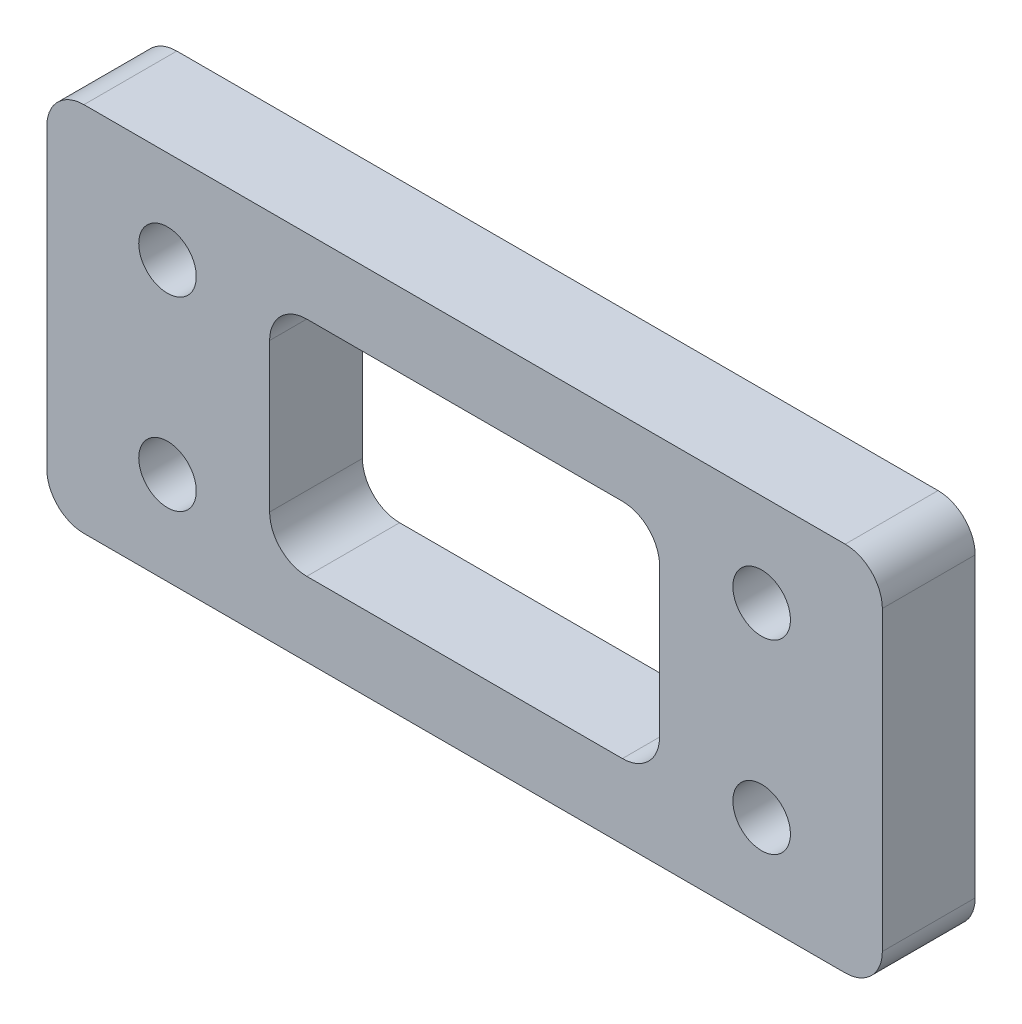
ISO-10303-21;
HEADER;
FILE_DESCRIPTION(('STEP AP214'),'2;1');
FILE_NAME('part.step','',(''),(''),'','','');
FILE_SCHEMA(('AUTOMOTIVE_DESIGN { 1 0 10303 214 1 1 1 1 }'));
ENDSEC;
DATA;
#1=APPLICATION_CONTEXT('core data for automotive mechanical design processes');
#2=APPLICATION_PROTOCOL_DEFINITION('international standard','automotive_design',2000,#1);
#3=PRODUCT_CONTEXT('',#1,'mechanical');
#4=PRODUCT('Part','Part','',(#3));
#5=PRODUCT_RELATED_PRODUCT_CATEGORY('part','',(#4));
#6=PRODUCT_DEFINITION_FORMATION('','',#4);
#7=PRODUCT_DEFINITION_CONTEXT('part definition',#1,'design');
#8=PRODUCT_DEFINITION('design','',#6,#7);
#9=PRODUCT_DEFINITION_SHAPE('','',#8);
#10=(LENGTH_UNIT() NAMED_UNIT(*) SI_UNIT(.MILLI.,.METRE.));
#11=(NAMED_UNIT(*) PLANE_ANGLE_UNIT() SI_UNIT($,.RADIAN.));
#12=(NAMED_UNIT(*) SI_UNIT($,.STERADIAN.) SOLID_ANGLE_UNIT());
#13=UNCERTAINTY_MEASURE_WITH_UNIT(LENGTH_MEASURE(1.E-05),#10,'distance_accuracy_value','');
#14=(GEOMETRIC_REPRESENTATION_CONTEXT(3) GLOBAL_UNCERTAINTY_ASSIGNED_CONTEXT((#13)) GLOBAL_UNIT_ASSIGNED_CONTEXT((#10,
#11,#12)) REPRESENTATION_CONTEXT('',''));
#15=CARTESIAN_POINT('',(0.,0.,0.));
#16=DIRECTION('',(0.,0.,1.));
#17=DIRECTION('',(1.,0.,0.));
#18=AXIS2_PLACEMENT_3D('',#15,#16,#17);
#19=CARTESIAN_POINT('',(22.5,-10.,2.5));
#20=DIRECTION('',(-1.,0.,0.));
#21=DIRECTION('',(0.,0.,1.));
#22=AXIS2_PLACEMENT_3D('',#19,#20,#21);
#23=PLANE('',#22);
#24=DIRECTION('',(0.,1.,0.));
#25=VECTOR('',#24,1.);
#26=CARTESIAN_POINT('',(22.5,-10.,2.5));
#27=LINE('',#26,#25);
#28=CARTESIAN_POINT('',(22.5,-8.,2.5));
#29=VERTEX_POINT('',#28);
#30=CARTESIAN_POINT('',(22.5,8.,2.5));
#31=VERTEX_POINT('',#30);
#32=EDGE_CURVE('E175',#29,#31,#27,.T.);
#33=ORIENTED_EDGE('',*,*,#32,.F.);
#34=DIRECTION('',(0.,0.,-1.));
#35=VECTOR('',#34,1.);
#36=CARTESIAN_POINT('',(22.5,-8.,2.5));
#37=LINE('',#36,#35);
#38=CARTESIAN_POINT('',(22.5,-8.,-2.5));
#39=VERTEX_POINT('',#38);
#40=EDGE_CURVE('E224',#29,#39,#37,.T.);
#41=ORIENTED_EDGE('',*,*,#40,.T.);
#42=DIRECTION('',(0.,1.,0.));
#43=VECTOR('',#42,1.);
#44=CARTESIAN_POINT('',(22.5,-10.,-2.5));
#45=LINE('',#44,#43);
#46=CARTESIAN_POINT('',(22.5,8.,-2.5));
#47=VERTEX_POINT('',#46);
#48=EDGE_CURVE('E320',#39,#47,#45,.T.);
#49=ORIENTED_EDGE('',*,*,#48,.T.);
#50=DIRECTION('',(0.,0.,-1.));
#51=VECTOR('',#50,1.);
#52=CARTESIAN_POINT('',(22.5,8.,2.5));
#53=LINE('',#52,#51);
#54=EDGE_CURVE('E222',#47,#31,#53,.F.);
#55=ORIENTED_EDGE('',*,*,#54,.T.);
#56=EDGE_LOOP('',(#33,#41,#49,#55));
#57=FACE_BOUND('',#56,.T.);
#58=ADVANCED_FACE('F35',(#57),#23,.F.);
#59=CARTESIAN_POINT('',(-22.5,10.,2.5));
#60=DIRECTION('',(0.,-1.,0.));
#61=DIRECTION('',(0.,0.,-1.));
#62=AXIS2_PLACEMENT_3D('',#59,#60,#61);
#63=PLANE('',#62);
#64=DIRECTION('',(-1.,0.,0.));
#65=VECTOR('',#64,1.);
#66=CARTESIAN_POINT('',(-22.5,10.,-2.5));
#67=LINE('',#66,#65);
#68=CARTESIAN_POINT('',(20.5,10.,-2.5));
#69=VERTEX_POINT('',#68);
#70=CARTESIAN_POINT('',(-20.5,10.,-2.5));
#71=VERTEX_POINT('',#70);
#72=EDGE_CURVE('E181',#69,#71,#67,.T.);
#73=ORIENTED_EDGE('',*,*,#72,.T.);
#74=DIRECTION('',(0.,0.,-1.));
#75=VECTOR('',#74,1.);
#76=CARTESIAN_POINT('',(-20.5,10.,2.5));
#77=LINE('',#76,#75);
#78=CARTESIAN_POINT('',(-20.5,10.,2.5));
#79=VERTEX_POINT('',#78);
#80=EDGE_CURVE('E220',#71,#79,#77,.F.);
#81=ORIENTED_EDGE('',*,*,#80,.T.);
#82=DIRECTION('',(-1.,0.,0.));
#83=VECTOR('',#82,1.);
#84=CARTESIAN_POINT('',(-22.5,10.,2.5));
#85=LINE('',#84,#83);
#86=CARTESIAN_POINT('',(20.5,10.,2.5));
#87=VERTEX_POINT('',#86);
#88=EDGE_CURVE('E179',#87,#79,#85,.T.);
#89=ORIENTED_EDGE('',*,*,#88,.F.);
#90=DIRECTION('',(0.,0.,-1.));
#91=VECTOR('',#90,1.);
#92=CARTESIAN_POINT('',(20.5,10.,2.5));
#93=LINE('',#92,#91);
#94=EDGE_CURVE('E217',#87,#69,#93,.T.);
#95=ORIENTED_EDGE('',*,*,#94,.T.);
#96=EDGE_LOOP('',(#73,#81,#89,#95));
#97=FACE_BOUND('',#96,.T.);
#98=ADVANCED_FACE('F333',(#97),#63,.F.);
#99=CARTESIAN_POINT('',(-22.5,-10.,2.5));
#100=DIRECTION('',(1.,0.,0.));
#101=DIRECTION('',(0.,0.,-1.));
#102=AXIS2_PLACEMENT_3D('',#99,#100,#101);
#103=PLANE('',#102);
#104=DIRECTION('',(0.,-1.,0.));
#105=VECTOR('',#104,1.);
#106=CARTESIAN_POINT('',(-22.5,-10.,-2.5));
#107=LINE('',#106,#105);
#108=CARTESIAN_POINT('',(-22.5,8.,-2.5));
#109=VERTEX_POINT('',#108);
#110=CARTESIAN_POINT('',(-22.5,-8.,-2.5));
#111=VERTEX_POINT('',#110);
#112=EDGE_CURVE('E176',#109,#111,#107,.T.);
#113=ORIENTED_EDGE('',*,*,#112,.T.);
#114=DIRECTION('',(0.,0.,-1.));
#115=VECTOR('',#114,1.);
#116=CARTESIAN_POINT('',(-22.5,-8.,2.5));
#117=LINE('',#116,#115);
#118=CARTESIAN_POINT('',(-22.5,-8.,2.5));
#119=VERTEX_POINT('',#118);
#120=EDGE_CURVE('E153',#111,#119,#117,.F.);
#121=ORIENTED_EDGE('',*,*,#120,.T.);
#122=DIRECTION('',(0.,-1.,0.));
#123=VECTOR('',#122,1.);
#124=CARTESIAN_POINT('',(-22.5,-10.,2.5));
#125=LINE('',#124,#123);
#126=CARTESIAN_POINT('',(-22.5,8.,2.5));
#127=VERTEX_POINT('',#126);
#128=EDGE_CURVE('E324',#127,#119,#125,.T.);
#129=ORIENTED_EDGE('',*,*,#128,.F.);
#130=DIRECTION('',(0.,0.,-1.));
#131=VECTOR('',#130,1.);
#132=CARTESIAN_POINT('',(-22.5,8.,2.5));
#133=LINE('',#132,#131);
#134=EDGE_CURVE('E158',#127,#109,#133,.T.);
#135=ORIENTED_EDGE('',*,*,#134,.T.);
#136=EDGE_LOOP('',(#113,#121,#129,#135));
#137=FACE_BOUND('',#136,.T.);
#138=ADVANCED_FACE('F343',(#137),#103,.F.);
#139=CARTESIAN_POINT('',(-22.5,-10.,2.5));
#140=DIRECTION('',(0.,1.,0.));
#141=DIRECTION('',(0.,0.,1.));
#142=AXIS2_PLACEMENT_3D('',#139,#140,#141);
#143=PLANE('',#142);
#144=DIRECTION('',(1.,0.,0.));
#145=VECTOR('',#144,1.);
#146=CARTESIAN_POINT('',(-22.5,-10.,2.5));
#147=LINE('',#146,#145);
#148=CARTESIAN_POINT('',(-20.5,-10.,2.5));
#149=VERTEX_POINT('',#148);
#150=CARTESIAN_POINT('',(20.5,-10.,2.5));
#151=VERTEX_POINT('',#150);
#152=EDGE_CURVE('E168',#149,#151,#147,.T.);
#153=ORIENTED_EDGE('',*,*,#152,.F.);
#154=DIRECTION('',(0.,0.,-1.));
#155=VECTOR('',#154,1.);
#156=CARTESIAN_POINT('',(-20.5,-10.,2.5));
#157=LINE('',#156,#155);
#158=CARTESIAN_POINT('',(-20.5,-10.,-2.5));
#159=VERTEX_POINT('',#158);
#160=EDGE_CURVE('E152',#149,#159,#157,.T.);
#161=ORIENTED_EDGE('',*,*,#160,.T.);
#162=DIRECTION('',(1.,0.,0.));
#163=VECTOR('',#162,1.);
#164=CARTESIAN_POINT('',(-22.5,-10.,-2.5));
#165=LINE('',#164,#163);
#166=CARTESIAN_POINT('',(20.5,-10.,-2.5));
#167=VERTEX_POINT('',#166);
#168=EDGE_CURVE('E165',#159,#167,#165,.T.);
#169=ORIENTED_EDGE('',*,*,#168,.T.);
#170=DIRECTION('',(0.,0.,-1.));
#171=VECTOR('',#170,1.);
#172=CARTESIAN_POINT('',(20.5,-10.,2.5));
#173=LINE('',#172,#171);
#174=EDGE_CURVE('E170',#167,#151,#173,.F.);
#175=ORIENTED_EDGE('',*,*,#174,.T.);
#176=EDGE_LOOP('',(#153,#161,#169,#175));
#177=FACE_BOUND('',#176,.T.);
#178=ADVANCED_FACE('F164',(#177),#143,.F.);
#179=CARTESIAN_POINT('',(0.,0.,2.5));
#180=DIRECTION('',(0.,0.,-1.));
#181=DIRECTION('',(-1.,0.,0.));
#182=AXIS2_PLACEMENT_3D('',#179,#180,#181);
#183=PLANE('',#182);
#184=DIRECTION('',(-1.,0.,0.));
#185=VECTOR('',#184,1.);
#186=CARTESIAN_POINT('',(-10.5,6.,2.5));
#187=LINE('',#186,#185);
#188=CARTESIAN_POINT('',(8.5,6.,2.5));
#189=VERTEX_POINT('',#188);
#190=CARTESIAN_POINT('',(-8.5,6.,2.5));
#191=VERTEX_POINT('',#190);
#192=EDGE_CURVE('E272',#189,#191,#187,.T.);
#193=ORIENTED_EDGE('',*,*,#192,.F.);
#194=CARTESIAN_POINT('',(8.5,4.,2.5));
#195=DIRECTION('',(0.,0.,-1.));
#196=DIRECTION('',(-1.,0.,0.));
#197=AXIS2_PLACEMENT_3D('',#194,#195,#196);
#198=CIRCLE('',#197,2.);
#199=CARTESIAN_POINT('',(10.5,4.,2.5));
#200=VERTEX_POINT('',#199);
#201=EDGE_CURVE('E262',#189,#200,#198,.T.);
#202=ORIENTED_EDGE('',*,*,#201,.T.);
#203=DIRECTION('',(0.,1.,0.));
#204=VECTOR('',#203,1.);
#205=CARTESIAN_POINT('',(10.5,-6.,2.5));
#206=LINE('',#205,#204);
#207=CARTESIAN_POINT('',(10.5,-4.,2.5));
#208=VERTEX_POINT('',#207);
#209=EDGE_CURVE('E278',#208,#200,#206,.T.);
#210=ORIENTED_EDGE('',*,*,#209,.F.);
#211=CARTESIAN_POINT('',(8.5,-4.,2.5));
#212=DIRECTION('',(0.,0.,-1.));
#213=DIRECTION('',(-1.,0.,0.));
#214=AXIS2_PLACEMENT_3D('',#211,#212,#213);
#215=CIRCLE('',#214,2.);
#216=CARTESIAN_POINT('',(8.5,-6.,2.5));
#217=VERTEX_POINT('',#216);
#218=EDGE_CURVE('E258',#208,#217,#215,.T.);
#219=ORIENTED_EDGE('',*,*,#218,.T.);
#220=DIRECTION('',(1.,0.,0.));
#221=VECTOR('',#220,1.);
#222=CARTESIAN_POINT('',(-10.5,-6.,2.5));
#223=LINE('',#222,#221);
#224=CARTESIAN_POINT('',(-8.49999999999999,-6.,2.5));
#225=VERTEX_POINT('',#224);
#226=EDGE_CURVE('E189',#225,#217,#223,.T.);
#227=ORIENTED_EDGE('',*,*,#226,.F.);
#228=CARTESIAN_POINT('',(-8.49999999999999,-4.,2.5));
#229=DIRECTION('',(0.,0.,-1.));
#230=DIRECTION('',(-1.,0.,0.));
#231=AXIS2_PLACEMENT_3D('',#228,#229,#230);
#232=CIRCLE('',#231,2.);
#233=CARTESIAN_POINT('',(-10.5,-4.00000000000001,2.5));
#234=VERTEX_POINT('',#233);
#235=EDGE_CURVE('E50',#225,#234,#232,.T.);
#236=ORIENTED_EDGE('',*,*,#235,.T.);
#237=DIRECTION('',(0.,-1.,0.));
#238=VECTOR('',#237,1.);
#239=CARTESIAN_POINT('',(-10.5,-6.,2.5));
#240=LINE('',#239,#238);
#241=CARTESIAN_POINT('',(-10.5,3.99999999999999,2.5));
#242=VERTEX_POINT('',#241);
#243=EDGE_CURVE('E273',#242,#234,#240,.T.);
#244=ORIENTED_EDGE('',*,*,#243,.F.);
#245=CARTESIAN_POINT('',(-8.5,4.,2.5));
#246=DIRECTION('',(0.,0.,-1.));
#247=DIRECTION('',(-1.,0.,0.));
#248=AXIS2_PLACEMENT_3D('',#245,#246,#247);
#249=CIRCLE('',#248,2.);
#250=EDGE_CURVE('E43',#242,#191,#249,.T.);
#251=ORIENTED_EDGE('',*,*,#250,.T.);
#252=EDGE_LOOP('',(#193,#202,#210,#219,#227,#236,#244,#251));
#253=FACE_BOUND('',#252,.T.);
#254=CARTESIAN_POINT('',(15.9999999999999,-5.00000000000011,2.5));
#255=DIRECTION('',(0.,0.,-1.));
#256=DIRECTION('',(-1.,0.,0.));
#257=AXIS2_PLACEMENT_3D('',#254,#255,#256);
#258=CIRCLE('',#257,1.54999999999997);
#259=CARTESIAN_POINT('',(14.4499999999999,-5.00000000000011,2.5));
#260=VERTEX_POINT('',#259);
#261=EDGE_CURVE('E201',#260,#260,#258,.T.);
#262=ORIENTED_EDGE('',*,*,#261,.T.);
#263=EDGE_LOOP('',(#262));
#264=FACE_BOUND('',#263,.T.);
#265=CARTESIAN_POINT('',(-16.0000000000002,-5.00000000000011,2.5));
#266=DIRECTION('',(0.,0.,-1.));
#267=DIRECTION('',(-1.,0.,0.));
#268=AXIS2_PLACEMENT_3D('',#265,#266,#267);
#269=CIRCLE('',#268,1.54999999999994);
#270=CARTESIAN_POINT('',(-17.5500000000001,-5.00000000000011,2.5));
#271=VERTEX_POINT('',#270);
#272=EDGE_CURVE('E197',#271,#271,#269,.T.);
#273=ORIENTED_EDGE('',*,*,#272,.T.);
#274=EDGE_LOOP('',(#273));
#275=FACE_BOUND('',#274,.T.);
#276=CARTESIAN_POINT('',(-16.0000000000002,5.00000000000014,2.5));
#277=DIRECTION('',(0.,0.,-1.));
#278=DIRECTION('',(-1.,0.,0.));
#279=AXIS2_PLACEMENT_3D('',#276,#277,#278);
#280=CIRCLE('',#279,1.54999999999994);
#281=CARTESIAN_POINT('',(-17.5500000000001,5.00000000000014,2.5));
#282=VERTEX_POINT('',#281);
#283=EDGE_CURVE('E193',#282,#282,#280,.T.);
#284=ORIENTED_EDGE('',*,*,#283,.T.);
#285=EDGE_LOOP('',(#284));
#286=FACE_BOUND('',#285,.T.);
#287=CARTESIAN_POINT('',(15.9999999999999,5.00000000000014,2.5));
#288=DIRECTION('',(0.,0.,-1.));
#289=DIRECTION('',(-1.,0.,0.));
#290=AXIS2_PLACEMENT_3D('',#287,#288,#289);
#291=CIRCLE('',#290,1.54999999999997);
#292=CARTESIAN_POINT('',(14.4499999999999,5.00000000000014,2.5));
#293=VERTEX_POINT('',#292);
#294=EDGE_CURVE('E188',#293,#293,#291,.T.);
#295=ORIENTED_EDGE('',*,*,#294,.T.);
#296=EDGE_LOOP('',(#295));
#297=FACE_BOUND('',#296,.T.);
#298=ORIENTED_EDGE('',*,*,#128,.T.);
#299=CARTESIAN_POINT('',(-20.5,-8.,2.5));
#300=DIRECTION('',(0.,0.,-1.));
#301=DIRECTION('',(-1.,0.,0.));
#302=AXIS2_PLACEMENT_3D('',#299,#300,#301);
#303=CIRCLE('',#302,2.);
#304=EDGE_CURVE('E215',#119,#149,#303,.F.);
#305=ORIENTED_EDGE('',*,*,#304,.T.);
#306=ORIENTED_EDGE('',*,*,#152,.T.);
#307=CARTESIAN_POINT('',(20.5,-8.,2.5));
#308=DIRECTION('',(0.,0.,-1.));
#309=DIRECTION('',(-1.,0.,0.));
#310=AXIS2_PLACEMENT_3D('',#307,#308,#309);
#311=CIRCLE('',#310,2.);
#312=EDGE_CURVE('E211',#151,#29,#311,.F.);
#313=ORIENTED_EDGE('',*,*,#312,.T.);
#314=ORIENTED_EDGE('',*,*,#32,.T.);
#315=CARTESIAN_POINT('',(20.5,8.,2.5));
#316=DIRECTION('',(0.,0.,-1.));
#317=DIRECTION('',(-1.,0.,0.));
#318=AXIS2_PLACEMENT_3D('',#315,#316,#317);
#319=CIRCLE('',#318,2.);
#320=EDGE_CURVE('E209',#31,#87,#319,.F.);
#321=ORIENTED_EDGE('',*,*,#320,.T.);
#322=ORIENTED_EDGE('',*,*,#88,.T.);
#323=CARTESIAN_POINT('',(-20.5,8.,2.5));
#324=DIRECTION('',(0.,0.,-1.));
#325=DIRECTION('',(-1.,0.,0.));
#326=AXIS2_PLACEMENT_3D('',#323,#324,#325);
#327=CIRCLE('',#326,2.);
#328=EDGE_CURVE('E213',#79,#127,#327,.F.);
#329=ORIENTED_EDGE('',*,*,#328,.T.);
#330=EDGE_LOOP('',(#298,#305,#306,#313,#314,#321,#322,#329));
#331=FACE_BOUND('',#330,.T.);
#332=ADVANCED_FACE('F270',(#253,#264,#275,#286,#297,#331),#183,.F.);
#333=CARTESIAN_POINT('',(0.,0.,-2.5));
#334=DIRECTION('',(0.,0.,-1.));
#335=DIRECTION('',(-1.,0.,0.));
#336=AXIS2_PLACEMENT_3D('',#333,#334,#335);
#337=PLANE('',#336);
#338=DIRECTION('',(0.,-1.,0.));
#339=VECTOR('',#338,1.);
#340=CARTESIAN_POINT('',(10.5,0.,-2.5));
#341=LINE('',#340,#339);
#342=CARTESIAN_POINT('',(10.5,4.,-2.5));
#343=VERTEX_POINT('',#342);
#344=CARTESIAN_POINT('',(10.5,-4.,-2.5));
#345=VERTEX_POINT('',#344);
#346=EDGE_CURVE('E236',#343,#345,#341,.T.);
#347=ORIENTED_EDGE('',*,*,#346,.F.);
#348=CARTESIAN_POINT('',(8.5,4.,-2.5));
#349=DIRECTION('',(0.,0.,-1.));
#350=DIRECTION('',(-1.,0.,0.));
#351=AXIS2_PLACEMENT_3D('',#348,#349,#350);
#352=CIRCLE('',#351,2.);
#353=CARTESIAN_POINT('',(8.5,6.,-2.5));
#354=VERTEX_POINT('',#353);
#355=EDGE_CURVE('E264',#343,#354,#352,.F.);
#356=ORIENTED_EDGE('',*,*,#355,.T.);
#357=DIRECTION('',(1.,0.,0.));
#358=VECTOR('',#357,1.);
#359=CARTESIAN_POINT('',(0.,6.,-2.5));
#360=LINE('',#359,#358);
#361=CARTESIAN_POINT('',(-8.5,6.,-2.5));
#362=VERTEX_POINT('',#361);
#363=EDGE_CURVE('E227',#362,#354,#360,.T.);
#364=ORIENTED_EDGE('',*,*,#363,.F.);
#365=CARTESIAN_POINT('',(-8.5,4.,-2.5));
#366=DIRECTION('',(0.,0.,-1.));
#367=DIRECTION('',(-1.,0.,0.));
#368=AXIS2_PLACEMENT_3D('',#365,#366,#367);
#369=CIRCLE('',#368,2.);
#370=CARTESIAN_POINT('',(-10.5,4.,-2.5));
#371=VERTEX_POINT('',#370);
#372=EDGE_CURVE('E11',#362,#371,#369,.F.);
#373=ORIENTED_EDGE('',*,*,#372,.T.);
#374=DIRECTION('',(0.,1.,0.));
#375=VECTOR('',#374,1.);
#376=CARTESIAN_POINT('',(-10.5,0.,-2.5));
#377=LINE('',#376,#375);
#378=CARTESIAN_POINT('',(-10.5,-4.,-2.5));
#379=VERTEX_POINT('',#378);
#380=EDGE_CURVE('E230',#379,#371,#377,.T.);
#381=ORIENTED_EDGE('',*,*,#380,.F.);
#382=CARTESIAN_POINT('',(-8.49999999999999,-4.,-2.5));
#383=DIRECTION('',(0.,0.,-1.));
#384=DIRECTION('',(-1.,0.,0.));
#385=AXIS2_PLACEMENT_3D('',#382,#383,#384);
#386=CIRCLE('',#385,2.);
#387=CARTESIAN_POINT('',(-8.49999999999999,-6.,-2.5));
#388=VERTEX_POINT('',#387);
#389=EDGE_CURVE('E267',#379,#388,#386,.F.);
#390=ORIENTED_EDGE('',*,*,#389,.T.);
#391=DIRECTION('',(-1.,0.,0.));
#392=VECTOR('',#391,1.);
#393=CARTESIAN_POINT('',(0.,-6.,-2.5));
#394=LINE('',#393,#392);
#395=CARTESIAN_POINT('',(8.5,-6.,-2.5));
#396=VERTEX_POINT('',#395);
#397=EDGE_CURVE('E233',#396,#388,#394,.T.);
#398=ORIENTED_EDGE('',*,*,#397,.F.);
#399=CARTESIAN_POINT('',(8.5,-4.,-2.5));
#400=DIRECTION('',(0.,0.,-1.));
#401=DIRECTION('',(-1.,0.,0.));
#402=AXIS2_PLACEMENT_3D('',#399,#400,#401);
#403=CIRCLE('',#402,2.);
#404=EDGE_CURVE('E260',#396,#345,#403,.F.);
#405=ORIENTED_EDGE('',*,*,#404,.T.);
#406=EDGE_LOOP('',(#347,#356,#364,#373,#381,#390,#398,#405));
#407=FACE_BOUND('',#406,.T.);
#408=CARTESIAN_POINT('',(15.9999999999999,-5.00000000000011,-2.5));
#409=DIRECTION('',(0.,0.,-1.));
#410=DIRECTION('',(-1.,0.,0.));
#411=AXIS2_PLACEMENT_3D('',#408,#409,#410);
#412=CIRCLE('',#411,1.54999999999997);
#413=CARTESIAN_POINT('',(14.4499999999999,-5.00000000000011,-2.5));
#414=VERTEX_POINT('',#413);
#415=EDGE_CURVE('E198',#414,#414,#412,.T.);
#416=ORIENTED_EDGE('',*,*,#415,.F.);
#417=EDGE_LOOP('',(#416));
#418=FACE_BOUND('',#417,.T.);
#419=CARTESIAN_POINT('',(-16.0000000000002,-5.00000000000011,-2.5));
#420=DIRECTION('',(0.,0.,-1.));
#421=DIRECTION('',(-1.,0.,0.));
#422=AXIS2_PLACEMENT_3D('',#419,#420,#421);
#423=CIRCLE('',#422,1.54999999999994);
#424=CARTESIAN_POINT('',(-17.5500000000001,-5.00000000000011,-2.5));
#425=VERTEX_POINT('',#424);
#426=EDGE_CURVE('E194',#425,#425,#423,.T.);
#427=ORIENTED_EDGE('',*,*,#426,.F.);
#428=EDGE_LOOP('',(#427));
#429=FACE_BOUND('',#428,.T.);
#430=CARTESIAN_POINT('',(-16.0000000000002,5.00000000000014,-2.5));
#431=DIRECTION('',(0.,0.,-1.));
#432=DIRECTION('',(-1.,0.,0.));
#433=AXIS2_PLACEMENT_3D('',#430,#431,#432);
#434=CIRCLE('',#433,1.54999999999994);
#435=CARTESIAN_POINT('',(-17.5500000000001,5.00000000000014,-2.5));
#436=VERTEX_POINT('',#435);
#437=EDGE_CURVE('E190',#436,#436,#434,.T.);
#438=ORIENTED_EDGE('',*,*,#437,.F.);
#439=EDGE_LOOP('',(#438));
#440=FACE_BOUND('',#439,.T.);
#441=CARTESIAN_POINT('',(15.9999999999999,5.00000000000014,-2.5));
#442=DIRECTION('',(0.,0.,-1.));
#443=DIRECTION('',(-1.,0.,0.));
#444=AXIS2_PLACEMENT_3D('',#441,#442,#443);
#445=CIRCLE('',#444,1.54999999999997);
#446=CARTESIAN_POINT('',(14.4499999999999,5.00000000000014,-2.5));
#447=VERTEX_POINT('',#446);
#448=EDGE_CURVE('E185',#447,#447,#445,.T.);
#449=ORIENTED_EDGE('',*,*,#448,.F.);
#450=EDGE_LOOP('',(#449));
#451=FACE_BOUND('',#450,.T.);
#452=ORIENTED_EDGE('',*,*,#168,.F.);
#453=CARTESIAN_POINT('',(-20.5,-8.,-2.5));
#454=DIRECTION('',(0.,0.,-1.));
#455=DIRECTION('',(-1.,0.,0.));
#456=AXIS2_PLACEMENT_3D('',#453,#454,#455);
#457=CIRCLE('',#456,2.);
#458=EDGE_CURVE('E148',#159,#111,#457,.T.);
#459=ORIENTED_EDGE('',*,*,#458,.T.);
#460=ORIENTED_EDGE('',*,*,#112,.F.);
#461=CARTESIAN_POINT('',(-20.5,8.,-2.5));
#462=DIRECTION('',(0.,0.,-1.));
#463=DIRECTION('',(-1.,0.,0.));
#464=AXIS2_PLACEMENT_3D('',#461,#462,#463);
#465=CIRCLE('',#464,2.);
#466=EDGE_CURVE('E159',#109,#71,#465,.T.);
#467=ORIENTED_EDGE('',*,*,#466,.T.);
#468=ORIENTED_EDGE('',*,*,#72,.F.);
#469=CARTESIAN_POINT('',(20.5,8.,-2.5));
#470=DIRECTION('',(0.,0.,-1.));
#471=DIRECTION('',(-1.,0.,0.));
#472=AXIS2_PLACEMENT_3D('',#469,#470,#471);
#473=CIRCLE('',#472,2.);
#474=EDGE_CURVE('E169',#69,#47,#473,.T.);
#475=ORIENTED_EDGE('',*,*,#474,.T.);
#476=ORIENTED_EDGE('',*,*,#48,.F.);
#477=CARTESIAN_POINT('',(20.5,-8.,-2.5));
#478=DIRECTION('',(0.,0.,-1.));
#479=DIRECTION('',(-1.,0.,0.));
#480=AXIS2_PLACEMENT_3D('',#477,#478,#479);
#481=CIRCLE('',#480,2.);
#482=EDGE_CURVE('E174',#39,#167,#481,.T.);
#483=ORIENTED_EDGE('',*,*,#482,.T.);
#484=EDGE_LOOP('',(#452,#459,#460,#467,#468,#475,#476,#483));
#485=FACE_BOUND('',#484,.T.);
#486=ADVANCED_FACE('F172',(#407,#418,#429,#440,#451,#485),#337,.T.);
#487=CARTESIAN_POINT('',(15.9999999999999,5.00000000000014,-30.));
#488=DIRECTION('',(0.,0.,1.));
#489=DIRECTION('',(1.,0.,0.));
#490=AXIS2_PLACEMENT_3D('',#487,#488,#489);
#491=CYLINDRICAL_SURFACE('',#490,1.54999999999997);
#492=ORIENTED_EDGE('',*,*,#448,.T.);
#493=EDGE_LOOP('',(#492));
#494=FACE_BOUND('',#493,.T.);
#495=ORIENTED_EDGE('',*,*,#294,.F.);
#496=EDGE_LOOP('',(#495));
#497=FACE_BOUND('',#496,.T.);
#498=ADVANCED_FACE('F439',(#494,#497),#491,.F.);
#499=CARTESIAN_POINT('',(-16.0000000000002,5.00000000000014,-30.));
#500=DIRECTION('',(0.,0.,1.));
#501=DIRECTION('',(1.,0.,0.));
#502=AXIS2_PLACEMENT_3D('',#499,#500,#501);
#503=CYLINDRICAL_SURFACE('',#502,1.54999999999994);
#504=ORIENTED_EDGE('',*,*,#437,.T.);
#505=EDGE_LOOP('',(#504));
#506=FACE_BOUND('',#505,.T.);
#507=ORIENTED_EDGE('',*,*,#283,.F.);
#508=EDGE_LOOP('',(#507));
#509=FACE_BOUND('',#508,.T.);
#510=ADVANCED_FACE('F511',(#506,#509),#503,.F.);
#511=CARTESIAN_POINT('',(-16.0000000000002,-5.00000000000011,-30.));
#512=DIRECTION('',(0.,0.,1.));
#513=DIRECTION('',(1.,0.,0.));
#514=AXIS2_PLACEMENT_3D('',#511,#512,#513);
#515=CYLINDRICAL_SURFACE('',#514,1.54999999999994);
#516=ORIENTED_EDGE('',*,*,#426,.T.);
#517=EDGE_LOOP('',(#516));
#518=FACE_BOUND('',#517,.T.);
#519=ORIENTED_EDGE('',*,*,#272,.F.);
#520=EDGE_LOOP('',(#519));
#521=FACE_BOUND('',#520,.T.);
#522=ADVANCED_FACE('F501',(#518,#521),#515,.F.);
#523=CARTESIAN_POINT('',(15.9999999999999,-5.00000000000011,-30.));
#524=DIRECTION('',(0.,0.,1.));
#525=DIRECTION('',(1.,0.,0.));
#526=AXIS2_PLACEMENT_3D('',#523,#524,#525);
#527=CYLINDRICAL_SURFACE('',#526,1.54999999999997);
#528=ORIENTED_EDGE('',*,*,#415,.T.);
#529=EDGE_LOOP('',(#528));
#530=FACE_BOUND('',#529,.T.);
#531=ORIENTED_EDGE('',*,*,#261,.F.);
#532=EDGE_LOOP('',(#531));
#533=FACE_BOUND('',#532,.T.);
#534=ADVANCED_FACE('F361',(#530,#533),#527,.F.);
#535=CARTESIAN_POINT('',(-20.5,-8.,2.5));
#536=DIRECTION('',(0.,0.,-1.));
#537=DIRECTION('',(-1.,0.,0.));
#538=AXIS2_PLACEMENT_3D('',#535,#536,#537);
#539=CYLINDRICAL_SURFACE('',#538,2.);
#540=ORIENTED_EDGE('',*,*,#304,.F.);
#541=ORIENTED_EDGE('',*,*,#120,.F.);
#542=ORIENTED_EDGE('',*,*,#458,.F.);
#543=ORIENTED_EDGE('',*,*,#160,.F.);
#544=EDGE_LOOP('',(#540,#541,#542,#543));
#545=FACE_BOUND('',#544,.T.);
#546=ADVANCED_FACE('F151',(#545),#539,.T.);
#547=CARTESIAN_POINT('',(-20.5,8.,2.5));
#548=DIRECTION('',(0.,0.,-1.));
#549=DIRECTION('',(-1.,0.,0.));
#550=AXIS2_PLACEMENT_3D('',#547,#548,#549);
#551=CYLINDRICAL_SURFACE('',#550,2.);
#552=ORIENTED_EDGE('',*,*,#328,.F.);
#553=ORIENTED_EDGE('',*,*,#80,.F.);
#554=ORIENTED_EDGE('',*,*,#466,.F.);
#555=ORIENTED_EDGE('',*,*,#134,.F.);
#556=EDGE_LOOP('',(#552,#553,#554,#555));
#557=FACE_BOUND('',#556,.T.);
#558=ADVANCED_FACE('F338',(#557),#551,.T.);
#559=CARTESIAN_POINT('',(20.5,-8.,2.5));
#560=DIRECTION('',(0.,0.,-1.));
#561=DIRECTION('',(-1.,0.,0.));
#562=AXIS2_PLACEMENT_3D('',#559,#560,#561);
#563=CYLINDRICAL_SURFACE('',#562,2.);
#564=ORIENTED_EDGE('',*,*,#312,.F.);
#565=ORIENTED_EDGE('',*,*,#174,.F.);
#566=ORIENTED_EDGE('',*,*,#482,.F.);
#567=ORIENTED_EDGE('',*,*,#40,.F.);
#568=EDGE_LOOP('',(#564,#565,#566,#567));
#569=FACE_BOUND('',#568,.T.);
#570=ADVANCED_FACE('F364',(#569),#563,.T.);
#571=CARTESIAN_POINT('',(20.5,8.,2.5));
#572=DIRECTION('',(0.,0.,-1.));
#573=DIRECTION('',(-1.,0.,0.));
#574=AXIS2_PLACEMENT_3D('',#571,#572,#573);
#575=CYLINDRICAL_SURFACE('',#574,2.);
#576=ORIENTED_EDGE('',*,*,#320,.F.);
#577=ORIENTED_EDGE('',*,*,#54,.F.);
#578=ORIENTED_EDGE('',*,*,#474,.F.);
#579=ORIENTED_EDGE('',*,*,#94,.F.);
#580=EDGE_LOOP('',(#576,#577,#578,#579));
#581=FACE_BOUND('',#580,.T.);
#582=ADVANCED_FACE('F367',(#581),#575,.T.);
#583=CARTESIAN_POINT('',(10.5,-6.,-27.5));
#584=DIRECTION('',(1.,0.,0.));
#585=DIRECTION('',(0.,0.,-1.));
#586=AXIS2_PLACEMENT_3D('',#583,#584,#585);
#587=PLANE('',#586);
#588=ORIENTED_EDGE('',*,*,#346,.T.);
#589=DIRECTION('',(0.,0.,1.));
#590=VECTOR('',#589,1.);
#591=CARTESIAN_POINT('',(10.5,-4.,2.5));
#592=LINE('',#591,#590);
#593=EDGE_CURVE('E241',#345,#208,#592,.T.);
#594=ORIENTED_EDGE('',*,*,#593,.T.);
#595=ORIENTED_EDGE('',*,*,#209,.T.);
#596=DIRECTION('',(0.,0.,1.));
#597=VECTOR('',#596,1.);
#598=CARTESIAN_POINT('',(10.5,4.,-2.5));
#599=LINE('',#598,#597);
#600=EDGE_CURVE('E239',#200,#343,#599,.F.);
#601=ORIENTED_EDGE('',*,*,#600,.T.);
#602=EDGE_LOOP('',(#588,#594,#595,#601));
#603=FACE_BOUND('',#602,.T.);
#604=ADVANCED_FACE('F303',(#603),#587,.F.);
#605=CARTESIAN_POINT('',(-10.5,-6.,-27.5));
#606=DIRECTION('',(0.,-1.,0.));
#607=DIRECTION('',(1.,0.,0.));
#608=AXIS2_PLACEMENT_3D('',#605,#606,#607);
#609=PLANE('',#608);
#610=ORIENTED_EDGE('',*,*,#226,.T.);
#611=DIRECTION('',(0.,0.,1.));
#612=VECTOR('',#611,1.);
#613=CARTESIAN_POINT('',(8.5,-6.,-2.5));
#614=LINE('',#613,#612);
#615=EDGE_CURVE('E247',#217,#396,#614,.F.);
#616=ORIENTED_EDGE('',*,*,#615,.T.);
#617=ORIENTED_EDGE('',*,*,#397,.T.);
#618=DIRECTION('',(0.,0.,1.));
#619=VECTOR('',#618,1.);
#620=CARTESIAN_POINT('',(-8.49999999999999,-6.,2.5));
#621=LINE('',#620,#619);
#622=EDGE_CURVE('E244',#388,#225,#621,.T.);
#623=ORIENTED_EDGE('',*,*,#622,.T.);
#624=EDGE_LOOP('',(#610,#616,#617,#623));
#625=FACE_BOUND('',#624,.T.);
#626=ADVANCED_FACE('F296',(#625),#609,.F.);
#627=CARTESIAN_POINT('',(-10.5,-6.,-27.5));
#628=DIRECTION('',(-1.,0.,0.));
#629=DIRECTION('',(0.,-1.,0.));
#630=AXIS2_PLACEMENT_3D('',#627,#628,#629);
#631=PLANE('',#630);
#632=ORIENTED_EDGE('',*,*,#243,.T.);
#633=DIRECTION('',(0.,0.,1.));
#634=VECTOR('',#633,1.);
#635=CARTESIAN_POINT('',(-10.5,-4.,-2.5));
#636=LINE('',#635,#634);
#637=EDGE_CURVE('E256',#234,#379,#636,.F.);
#638=ORIENTED_EDGE('',*,*,#637,.T.);
#639=ORIENTED_EDGE('',*,*,#380,.T.);
#640=DIRECTION('',(0.,0.,1.));
#641=VECTOR('',#640,1.);
#642=CARTESIAN_POINT('',(-10.5,4.,2.5));
#643=LINE('',#642,#641);
#644=EDGE_CURVE('E254',#371,#242,#643,.T.);
#645=ORIENTED_EDGE('',*,*,#644,.T.);
#646=EDGE_LOOP('',(#632,#638,#639,#645));
#647=FACE_BOUND('',#646,.T.);
#648=ADVANCED_FACE('F287',(#647),#631,.F.);
#649=CARTESIAN_POINT('',(-10.5,6.,-27.5));
#650=DIRECTION('',(0.,1.,0.));
#651=DIRECTION('',(-1.,0.,0.));
#652=AXIS2_PLACEMENT_3D('',#649,#650,#651);
#653=PLANE('',#652);
#654=ORIENTED_EDGE('',*,*,#363,.T.);
#655=DIRECTION('',(0.,0.,1.));
#656=VECTOR('',#655,1.);
#657=CARTESIAN_POINT('',(8.5,6.,2.5));
#658=LINE('',#657,#656);
#659=EDGE_CURVE('E251',#354,#189,#658,.T.);
#660=ORIENTED_EDGE('',*,*,#659,.T.);
#661=ORIENTED_EDGE('',*,*,#192,.T.);
#662=DIRECTION('',(0.,0.,1.));
#663=VECTOR('',#662,1.);
#664=CARTESIAN_POINT('',(-8.5,6.,-2.5));
#665=LINE('',#664,#663);
#666=EDGE_CURVE('E249',#191,#362,#665,.F.);
#667=ORIENTED_EDGE('',*,*,#666,.T.);
#668=EDGE_LOOP('',(#654,#660,#661,#667));
#669=FACE_BOUND('',#668,.T.);
#670=ADVANCED_FACE('F275',(#669),#653,.F.);
#671=CARTESIAN_POINT('',(8.5,-4.,-27.5));
#672=DIRECTION('',(0.,0.,-1.));
#673=DIRECTION('',(-1.,0.,0.));
#674=AXIS2_PLACEMENT_3D('',#671,#672,#673);
#675=CYLINDRICAL_SURFACE('',#674,2.);
#676=ORIENTED_EDGE('',*,*,#404,.F.);
#677=ORIENTED_EDGE('',*,*,#615,.F.);
#678=ORIENTED_EDGE('',*,*,#218,.F.);
#679=ORIENTED_EDGE('',*,*,#593,.F.);
#680=EDGE_LOOP('',(#676,#677,#678,#679));
#681=FACE_BOUND('',#680,.T.);
#682=ADVANCED_FACE('F299',(#681),#675,.F.);
#683=CARTESIAN_POINT('',(8.5,4.,-27.5));
#684=DIRECTION('',(0.,0.,-1.));
#685=DIRECTION('',(-1.,0.,0.));
#686=AXIS2_PLACEMENT_3D('',#683,#684,#685);
#687=CYLINDRICAL_SURFACE('',#686,2.);
#688=ORIENTED_EDGE('',*,*,#355,.F.);
#689=ORIENTED_EDGE('',*,*,#600,.F.);
#690=ORIENTED_EDGE('',*,*,#201,.F.);
#691=ORIENTED_EDGE('',*,*,#659,.F.);
#692=EDGE_LOOP('',(#688,#689,#690,#691));
#693=FACE_BOUND('',#692,.T.);
#694=ADVANCED_FACE('F308',(#693),#687,.F.);
#695=CARTESIAN_POINT('',(-8.49999999999999,-4.,-27.5));
#696=DIRECTION('',(0.,0.,-1.));
#697=DIRECTION('',(-1.,0.,0.));
#698=AXIS2_PLACEMENT_3D('',#695,#696,#697);
#699=CYLINDRICAL_SURFACE('',#698,2.);
#700=ORIENTED_EDGE('',*,*,#389,.F.);
#701=ORIENTED_EDGE('',*,*,#637,.F.);
#702=ORIENTED_EDGE('',*,*,#235,.F.);
#703=ORIENTED_EDGE('',*,*,#622,.F.);
#704=EDGE_LOOP('',(#700,#701,#702,#703));
#705=FACE_BOUND('',#704,.T.);
#706=ADVANCED_FACE('F290',(#705),#699,.F.);
#707=CARTESIAN_POINT('',(-8.5,4.,-27.5));
#708=DIRECTION('',(0.,0.,-1.));
#709=DIRECTION('',(-1.,0.,0.));
#710=AXIS2_PLACEMENT_3D('',#707,#708,#709);
#711=CYLINDRICAL_SURFACE('',#710,2.);
#712=ORIENTED_EDGE('',*,*,#372,.F.);
#713=ORIENTED_EDGE('',*,*,#666,.F.);
#714=ORIENTED_EDGE('',*,*,#250,.F.);
#715=ORIENTED_EDGE('',*,*,#644,.F.);
#716=EDGE_LOOP('',(#712,#713,#714,#715));
#717=FACE_BOUND('',#716,.T.);
#718=ADVANCED_FACE('F37',(#717),#711,.F.);
#719=CLOSED_SHELL('',(#58,#98,#138,#178,#332,#486,#498,#510,#522,#534,#546,#558,#570,#582,#604,
#626,#648,#670,#682,#694,#706,#718));
#720=MANIFOLD_SOLID_BREP('B2',#719);
#721=ADVANCED_BREP_SHAPE_REPRESENTATION('',(#18,#720),#14);
#722=SHAPE_DEFINITION_REPRESENTATION(#9,#721);
ENDSEC;
END-ISO-10303-21;
